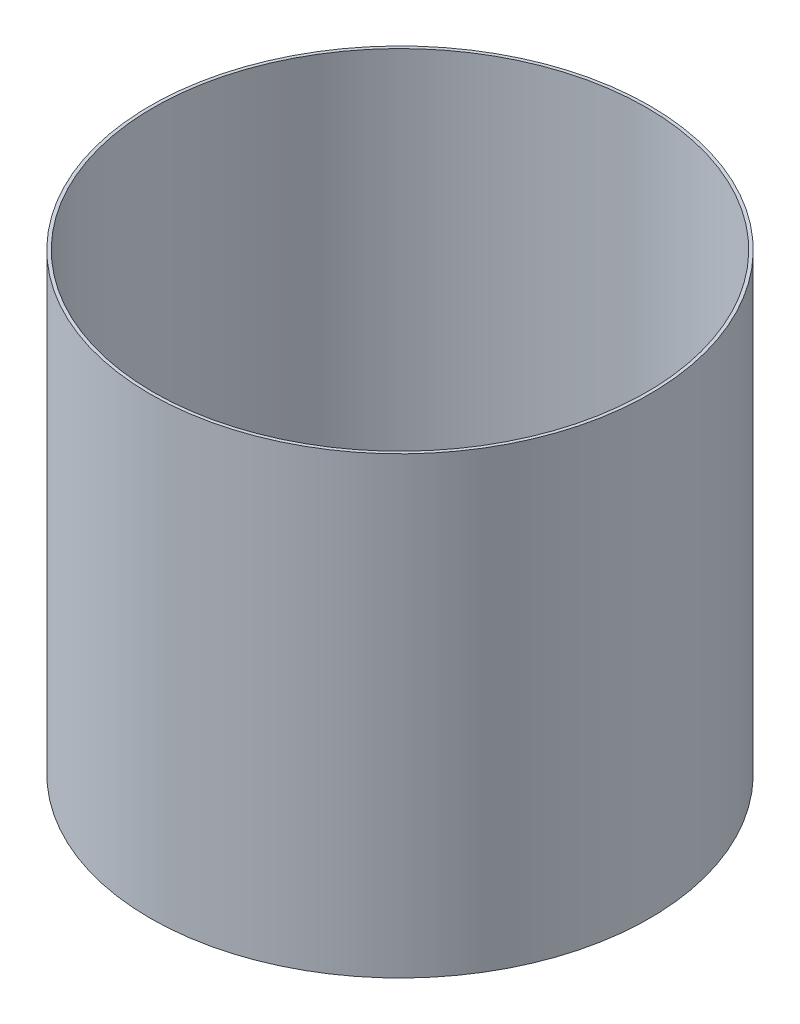
ISO-10303-21;
HEADER;
FILE_DESCRIPTION(('STEP AP214'),'2;1');
FILE_NAME('part.step','',(''),(''),'','','');
FILE_SCHEMA(('AUTOMOTIVE_DESIGN { 1 0 10303 214 1 1 1 1 }'));
ENDSEC;
DATA;
#1=APPLICATION_CONTEXT('core data for automotive mechanical design processes');
#2=APPLICATION_PROTOCOL_DEFINITION('international standard','automotive_design',2000,#1);
#3=PRODUCT_CONTEXT('',#1,'mechanical');
#4=PRODUCT('Part','Part','',(#3));
#5=PRODUCT_RELATED_PRODUCT_CATEGORY('part','',(#4));
#6=PRODUCT_DEFINITION_FORMATION('','',#4);
#7=PRODUCT_DEFINITION_CONTEXT('part definition',#1,'design');
#8=PRODUCT_DEFINITION('design','',#6,#7);
#9=PRODUCT_DEFINITION_SHAPE('','',#8);
#10=(LENGTH_UNIT() NAMED_UNIT(*) SI_UNIT(.MILLI.,.METRE.));
#11=(NAMED_UNIT(*) PLANE_ANGLE_UNIT() SI_UNIT($,.RADIAN.));
#12=(NAMED_UNIT(*) SI_UNIT($,.STERADIAN.) SOLID_ANGLE_UNIT());
#13=UNCERTAINTY_MEASURE_WITH_UNIT(LENGTH_MEASURE(1.E-05),#10,'distance_accuracy_value','');
#14=(GEOMETRIC_REPRESENTATION_CONTEXT(3) GLOBAL_UNCERTAINTY_ASSIGNED_CONTEXT((#13)) GLOBAL_UNIT_ASSIGNED_CONTEXT((#10,
#11,#12)) REPRESENTATION_CONTEXT('',''));
#15=CARTESIAN_POINT('',(0.,0.,0.));
#16=DIRECTION('',(0.,0.,1.));
#17=DIRECTION('',(1.,0.,0.));
#18=AXIS2_PLACEMENT_3D('',#15,#16,#17);
#19=CARTESIAN_POINT('',(0.,234.95,0.));
#20=DIRECTION('',(0.,1.,0.));
#21=DIRECTION('',(0.,0.,1.));
#22=AXIS2_PLACEMENT_3D('',#19,#20,#21);
#23=PLANE('',#22);
#24=CARTESIAN_POINT('',(0.,234.95,0.));
#25=DIRECTION('',(0.,1.,0.));
#26=DIRECTION('',(0.,0.,1.));
#27=AXIS2_PLACEMENT_3D('',#24,#25,#26);
#28=CIRCLE('',#27,130.175);
#29=CARTESIAN_POINT('',(0.,234.95,130.175));
#30=VERTEX_POINT('',#29);
#31=EDGE_CURVE('E10',#30,#30,#28,.T.);
#32=ORIENTED_EDGE('',*,*,#31,.T.);
#33=EDGE_LOOP('',(#32));
#34=FACE_BOUND('',#33,.T.);
#35=CARTESIAN_POINT('',(0.,234.95,0.));
#36=DIRECTION('',(0.,1.,0.));
#37=DIRECTION('',(0.,0.,1.));
#38=AXIS2_PLACEMENT_3D('',#35,#36,#37);
#39=CIRCLE('',#38,128.525);
#40=CARTESIAN_POINT('',(0.,234.95,128.525));
#41=VERTEX_POINT('',#40);
#42=EDGE_CURVE('E54',#41,#41,#39,.T.);
#43=ORIENTED_EDGE('',*,*,#42,.F.);
#44=EDGE_LOOP('',(#43));
#45=FACE_BOUND('',#44,.T.);
#46=ADVANCED_FACE('F47',(#34,#45),#23,.T.);
#47=CARTESIAN_POINT('',(0.,234.95,0.));
#48=DIRECTION('',(0.,-1.,0.));
#49=DIRECTION('',(0.,0.,-1.));
#50=AXIS2_PLACEMENT_3D('',#47,#48,#49);
#51=CYLINDRICAL_SURFACE('',#50,130.175);
#52=ORIENTED_EDGE('',*,*,#31,.F.);
#53=EDGE_LOOP('',(#52));
#54=FACE_BOUND('',#53,.T.);
#55=CARTESIAN_POINT('',(0.,-1.65,0.));
#56=DIRECTION('',(0.,-1.,0.));
#57=DIRECTION('',(0.,0.,-1.));
#58=AXIS2_PLACEMENT_3D('',#55,#56,#57);
#59=CIRCLE('',#58,130.175);
#60=CARTESIAN_POINT('',(0.,-1.65,-130.175));
#61=VERTEX_POINT('',#60);
#62=EDGE_CURVE('E63',#61,#61,#59,.T.);
#63=ORIENTED_EDGE('',*,*,#62,.F.);
#64=EDGE_LOOP('',(#63));
#65=FACE_BOUND('',#64,.T.);
#66=ADVANCED_FACE('F49',(#54,#65),#51,.T.);
#67=CARTESIAN_POINT('',(0.,234.95,0.));
#68=DIRECTION('',(0.,-1.,0.));
#69=DIRECTION('',(0.,0.,-1.));
#70=AXIS2_PLACEMENT_3D('',#67,#68,#69);
#71=CYLINDRICAL_SURFACE('',#70,128.525);
#72=ORIENTED_EDGE('',*,*,#42,.T.);
#73=EDGE_LOOP('',(#72));
#74=FACE_BOUND('',#73,.T.);
#75=CARTESIAN_POINT('',(0.,0.,0.));
#76=DIRECTION('',(0.,1.,0.));
#77=DIRECTION('',(0.,0.,1.));
#78=AXIS2_PLACEMENT_3D('',#75,#76,#77);
#79=CIRCLE('',#78,128.525);
#80=CARTESIAN_POINT('',(0.,0.,128.525));
#81=VERTEX_POINT('',#80);
#82=EDGE_CURVE('E58',#81,#81,#79,.T.);
#83=ORIENTED_EDGE('',*,*,#82,.F.);
#84=EDGE_LOOP('',(#83));
#85=FACE_BOUND('',#84,.T.);
#86=ADVANCED_FACE('F85',(#74,#85),#71,.F.);
#87=CARTESIAN_POINT('',(0.,0.,0.));
#88=DIRECTION('',(0.,-1.,0.));
#89=DIRECTION('',(0.,0.,-1.));
#90=AXIS2_PLACEMENT_3D('',#87,#88,#89);
#91=PLANE('',#90);
#92=CARTESIAN_POINT('',(0.,0.,0.));
#93=DIRECTION('',(0.,-1.,0.));
#94=DIRECTION('',(0.,0.,-1.));
#95=AXIS2_PLACEMENT_3D('',#92,#93,#94);
#96=CIRCLE('',#95,3.96875);
#97=CARTESIAN_POINT('',(0.,0.,-3.96875));
#98=VERTEX_POINT('',#97);
#99=EDGE_CURVE('E67',#98,#98,#96,.T.);
#100=ORIENTED_EDGE('',*,*,#99,.T.);
#101=EDGE_LOOP('',(#100));
#102=FACE_BOUND('',#101,.T.);
#103=ORIENTED_EDGE('',*,*,#82,.T.);
#104=EDGE_LOOP('',(#103));
#105=FACE_BOUND('',#104,.T.);
#106=ADVANCED_FACE('F80',(#102,#105),#91,.F.);
#107=CARTESIAN_POINT('',(0.,-1.65,0.));
#108=DIRECTION('',(0.,-1.,0.));
#109=DIRECTION('',(0.,0.,-1.));
#110=AXIS2_PLACEMENT_3D('',#107,#108,#109);
#111=PLANE('',#110);
#112=CARTESIAN_POINT('',(0.,-1.65,0.));
#113=DIRECTION('',(0.,-1.,0.));
#114=DIRECTION('',(0.,0.,-1.));
#115=AXIS2_PLACEMENT_3D('',#112,#113,#114);
#116=CIRCLE('',#115,3.96875);
#117=CARTESIAN_POINT('',(0.,-1.65,-3.96875));
#118=VERTEX_POINT('',#117);
#119=EDGE_CURVE('E70',#118,#118,#116,.T.);
#120=ORIENTED_EDGE('',*,*,#119,.F.);
#121=EDGE_LOOP('',(#120));
#122=FACE_BOUND('',#121,.T.);
#123=ORIENTED_EDGE('',*,*,#62,.T.);
#124=EDGE_LOOP('',(#123));
#125=FACE_BOUND('',#124,.T.);
#126=ADVANCED_FACE('F77',(#122,#125),#111,.T.);
#127=CARTESIAN_POINT('',(0.,234.95,0.));
#128=DIRECTION('',(0.,-1.,0.));
#129=DIRECTION('',(0.,0.,-1.));
#130=AXIS2_PLACEMENT_3D('',#127,#128,#129);
#131=CYLINDRICAL_SURFACE('',#130,3.96875);
#132=ORIENTED_EDGE('',*,*,#119,.T.);
#133=EDGE_LOOP('',(#132));
#134=FACE_BOUND('',#133,.T.);
#135=ORIENTED_EDGE('',*,*,#99,.F.);
#136=EDGE_LOOP('',(#135));
#137=FACE_BOUND('',#136,.T.);
#138=ADVANCED_FACE('F74',(#134,#137),#131,.F.);
#139=CLOSED_SHELL('',(#46,#66,#86,#106,#126,#138));
#140=MANIFOLD_SOLID_BREP('B2',#139);
#141=ADVANCED_BREP_SHAPE_REPRESENTATION('',(#18,#140),#14);
#142=SHAPE_DEFINITION_REPRESENTATION(#9,#141);
ENDSEC;
END-ISO-10303-21;
